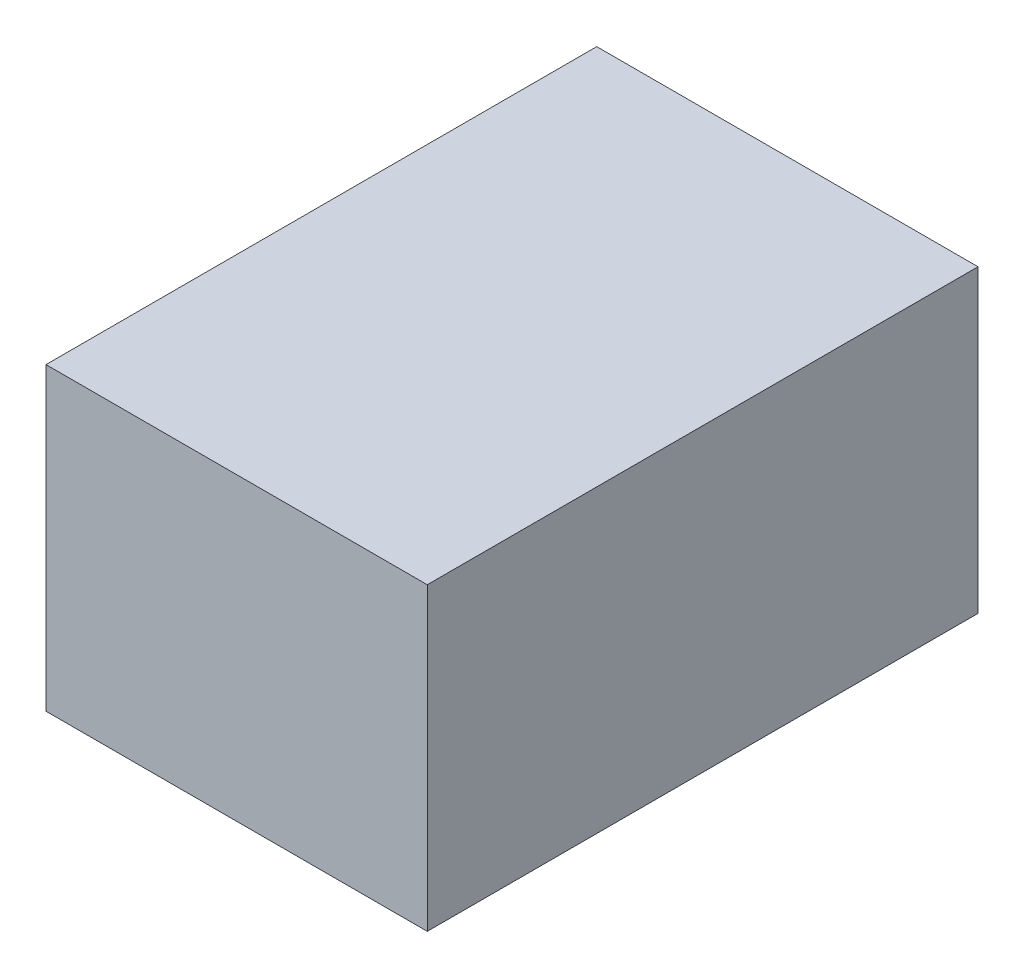
ISO-10303-21;
HEADER;
FILE_DESCRIPTION(('STEP AP214'),'2;1');
FILE_NAME('part.step','',(''),(''),'','','');
FILE_SCHEMA(('AUTOMOTIVE_DESIGN { 1 0 10303 214 1 1 1 1 }'));
ENDSEC;
DATA;
#1=APPLICATION_CONTEXT('core data for automotive mechanical design processes');
#2=APPLICATION_PROTOCOL_DEFINITION('international standard','automotive_design',2000,#1);
#3=PRODUCT_CONTEXT('',#1,'mechanical');
#4=PRODUCT('Part','Part','',(#3));
#5=PRODUCT_RELATED_PRODUCT_CATEGORY('part','',(#4));
#6=PRODUCT_DEFINITION_FORMATION('','',#4);
#7=PRODUCT_DEFINITION_CONTEXT('part definition',#1,'design');
#8=PRODUCT_DEFINITION('design','',#6,#7);
#9=PRODUCT_DEFINITION_SHAPE('','',#8);
#10=(LENGTH_UNIT() NAMED_UNIT(*) SI_UNIT(.MILLI.,.METRE.));
#11=(NAMED_UNIT(*) PLANE_ANGLE_UNIT() SI_UNIT($,.RADIAN.));
#12=(NAMED_UNIT(*) SI_UNIT($,.STERADIAN.) SOLID_ANGLE_UNIT());
#13=UNCERTAINTY_MEASURE_WITH_UNIT(LENGTH_MEASURE(1.E-05),#10,'distance_accuracy_value','');
#14=(GEOMETRIC_REPRESENTATION_CONTEXT(3) GLOBAL_UNCERTAINTY_ASSIGNED_CONTEXT((#13)) GLOBAL_UNIT_ASSIGNED_CONTEXT((#10,
#11,#12)) REPRESENTATION_CONTEXT('',''));
#15=CARTESIAN_POINT('',(0.,0.,0.));
#16=DIRECTION('',(0.,0.,1.));
#17=DIRECTION('',(1.,0.,0.));
#18=AXIS2_PLACEMENT_3D('',#15,#16,#17);
#19=CARTESIAN_POINT('',(-11.43,18.,16.51));
#20=DIRECTION('',(1.,0.,0.));
#21=DIRECTION('',(0.,0.,-1.));
#22=AXIS2_PLACEMENT_3D('',#19,#20,#21);
#23=PLANE('',#22);
#24=DIRECTION('',(0.,0.,1.));
#25=VECTOR('',#24,1.);
#26=CARTESIAN_POINT('',(-11.43,0.,16.51));
#27=LINE('',#26,#25);
#28=CARTESIAN_POINT('',(-11.43,0.,-16.51));
#29=VERTEX_POINT('',#28);
#30=CARTESIAN_POINT('',(-11.43,0.,16.51));
#31=VERTEX_POINT('',#30);
#32=EDGE_CURVE('E96',#29,#31,#27,.T.);
#33=ORIENTED_EDGE('',*,*,#32,.T.);
#34=DIRECTION('',(0.,-1.,0.));
#35=VECTOR('',#34,1.);
#36=CARTESIAN_POINT('',(-11.43,18.,16.51));
#37=LINE('',#36,#35);
#38=CARTESIAN_POINT('',(-11.43,18.,16.51));
#39=VERTEX_POINT('',#38);
#40=EDGE_CURVE('E11',#39,#31,#37,.T.);
#41=ORIENTED_EDGE('',*,*,#40,.F.);
#42=DIRECTION('',(0.,0.,1.));
#43=VECTOR('',#42,1.);
#44=CARTESIAN_POINT('',(-11.43,18.,16.51));
#45=LINE('',#44,#43);
#46=CARTESIAN_POINT('',(-11.43,18.,-16.51));
#47=VERTEX_POINT('',#46);
#48=EDGE_CURVE('E84',#47,#39,#45,.T.);
#49=ORIENTED_EDGE('',*,*,#48,.F.);
#50=DIRECTION('',(0.,-1.,0.));
#51=VECTOR('',#50,1.);
#52=CARTESIAN_POINT('',(-11.43,18.,-16.51));
#53=LINE('',#52,#51);
#54=EDGE_CURVE('E92',#47,#29,#53,.T.);
#55=ORIENTED_EDGE('',*,*,#54,.T.);
#56=EDGE_LOOP('',(#33,#41,#49,#55));
#57=FACE_BOUND('',#56,.T.);
#58=ADVANCED_FACE('F33',(#57),#23,.F.);
#59=CARTESIAN_POINT('',(11.43,18.,16.51));
#60=DIRECTION('',(0.,0.,-1.));
#61=DIRECTION('',(-1.,0.,0.));
#62=AXIS2_PLACEMENT_3D('',#59,#60,#61);
#63=PLANE('',#62);
#64=DIRECTION('',(1.,0.,0.));
#65=VECTOR('',#64,1.);
#66=CARTESIAN_POINT('',(11.43,0.,16.51));
#67=LINE('',#66,#65);
#68=CARTESIAN_POINT('',(11.43,0.,16.51));
#69=VERTEX_POINT('',#68);
#70=EDGE_CURVE('E88',#31,#69,#67,.T.);
#71=ORIENTED_EDGE('',*,*,#70,.T.);
#72=DIRECTION('',(0.,-1.,0.));
#73=VECTOR('',#72,1.);
#74=CARTESIAN_POINT('',(11.43,18.,16.51));
#75=LINE('',#74,#73);
#76=CARTESIAN_POINT('',(11.43,18.,16.51));
#77=VERTEX_POINT('',#76);
#78=EDGE_CURVE('E41',#77,#69,#75,.T.);
#79=ORIENTED_EDGE('',*,*,#78,.F.);
#80=DIRECTION('',(1.,0.,0.));
#81=VECTOR('',#80,1.);
#82=CARTESIAN_POINT('',(11.43,18.,16.51));
#83=LINE('',#82,#81);
#84=EDGE_CURVE('E79',#39,#77,#83,.T.);
#85=ORIENTED_EDGE('',*,*,#84,.F.);
#86=ORIENTED_EDGE('',*,*,#40,.T.);
#87=EDGE_LOOP('',(#71,#79,#85,#86));
#88=FACE_BOUND('',#87,.T.);
#89=ADVANCED_FACE('F87',(#88),#63,.F.);
#90=CARTESIAN_POINT('',(11.43,18.,16.51));
#91=DIRECTION('',(-1.,0.,0.));
#92=DIRECTION('',(0.,0.,1.));
#93=AXIS2_PLACEMENT_3D('',#90,#91,#92);
#94=PLANE('',#93);
#95=DIRECTION('',(0.,0.,-1.));
#96=VECTOR('',#95,1.);
#97=CARTESIAN_POINT('',(11.43,0.,16.51));
#98=LINE('',#97,#96);
#99=CARTESIAN_POINT('',(11.43,0.,-16.51));
#100=VERTEX_POINT('',#99);
#101=EDGE_CURVE('E66',#69,#100,#98,.T.);
#102=ORIENTED_EDGE('',*,*,#101,.T.);
#103=DIRECTION('',(0.,-1.,0.));
#104=VECTOR('',#103,1.);
#105=CARTESIAN_POINT('',(11.43,18.,-16.51));
#106=LINE('',#105,#104);
#107=CARTESIAN_POINT('',(11.43,18.,-16.51));
#108=VERTEX_POINT('',#107);
#109=EDGE_CURVE('E89',#108,#100,#106,.T.);
#110=ORIENTED_EDGE('',*,*,#109,.F.);
#111=DIRECTION('',(0.,0.,-1.));
#112=VECTOR('',#111,1.);
#113=CARTESIAN_POINT('',(11.43,18.,16.51));
#114=LINE('',#113,#112);
#115=EDGE_CURVE('E82',#77,#108,#114,.T.);
#116=ORIENTED_EDGE('',*,*,#115,.F.);
#117=ORIENTED_EDGE('',*,*,#78,.T.);
#118=EDGE_LOOP('',(#102,#110,#116,#117));
#119=FACE_BOUND('',#118,.T.);
#120=ADVANCED_FACE('F90',(#119),#94,.F.);
#121=CARTESIAN_POINT('',(11.43,18.,-16.51));
#122=DIRECTION('',(0.,0.,1.));
#123=DIRECTION('',(1.,0.,0.));
#124=AXIS2_PLACEMENT_3D('',#121,#122,#123);
#125=PLANE('',#124);
#126=DIRECTION('',(-1.,0.,0.));
#127=VECTOR('',#126,1.);
#128=CARTESIAN_POINT('',(11.43,0.,-16.51));
#129=LINE('',#128,#127);
#130=EDGE_CURVE('E72',#100,#29,#129,.T.);
#131=ORIENTED_EDGE('',*,*,#130,.T.);
#132=ORIENTED_EDGE('',*,*,#54,.F.);
#133=DIRECTION('',(-1.,0.,0.));
#134=VECTOR('',#133,1.);
#135=CARTESIAN_POINT('',(11.43,18.,-16.51));
#136=LINE('',#135,#134);
#137=EDGE_CURVE('E49',#108,#47,#136,.T.);
#138=ORIENTED_EDGE('',*,*,#137,.F.);
#139=ORIENTED_EDGE('',*,*,#109,.T.);
#140=EDGE_LOOP('',(#131,#132,#138,#139));
#141=FACE_BOUND('',#140,.T.);
#142=ADVANCED_FACE('F103',(#141),#125,.F.);
#143=CARTESIAN_POINT('',(0.,18.,0.));
#144=DIRECTION('',(0.,1.,0.));
#145=DIRECTION('',(0.,0.,1.));
#146=AXIS2_PLACEMENT_3D('',#143,#144,#145);
#147=PLANE('',#146);
#148=ORIENTED_EDGE('',*,*,#48,.T.);
#149=ORIENTED_EDGE('',*,*,#84,.T.);
#150=ORIENTED_EDGE('',*,*,#115,.T.);
#151=ORIENTED_EDGE('',*,*,#137,.T.);
#152=EDGE_LOOP('',(#148,#149,#150,#151));
#153=FACE_BOUND('',#152,.T.);
#154=ADVANCED_FACE('F80',(#153),#147,.T.);
#155=CARTESIAN_POINT('',(0.,0.,0.));
#156=DIRECTION('',(0.,1.,0.));
#157=DIRECTION('',(0.,0.,1.));
#158=AXIS2_PLACEMENT_3D('',#155,#156,#157);
#159=PLANE('',#158);
#160=ORIENTED_EDGE('',*,*,#32,.F.);
#161=ORIENTED_EDGE('',*,*,#130,.F.);
#162=ORIENTED_EDGE('',*,*,#101,.F.);
#163=ORIENTED_EDGE('',*,*,#70,.F.);
#164=EDGE_LOOP('',(#160,#161,#162,#163));
#165=FACE_BOUND('',#164,.T.);
#166=ADVANCED_FACE('F106',(#165),#159,.F.);
#167=CLOSED_SHELL('',(#58,#89,#120,#142,#154,#166));
#168=MANIFOLD_SOLID_BREP('B2',#167);
#169=ADVANCED_BREP_SHAPE_REPRESENTATION('',(#18,#168),#14);
#170=SHAPE_DEFINITION_REPRESENTATION(#9,#169);
ENDSEC;
END-ISO-10303-21;
